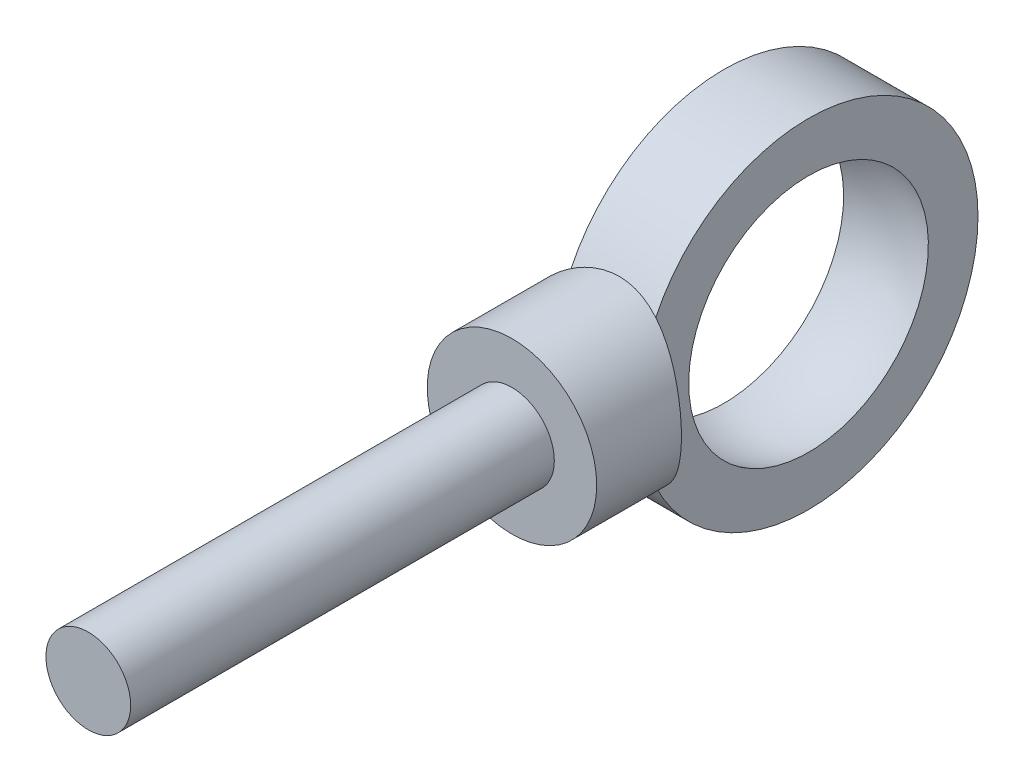
ISO-10303-21;
HEADER;
FILE_DESCRIPTION(('STEP AP214'),'2;1');
FILE_NAME('part.step','',(''),(''),'','','');
FILE_SCHEMA(('AUTOMOTIVE_DESIGN { 1 0 10303 214 1 1 1 1 }'));
ENDSEC;
DATA;
#1=APPLICATION_CONTEXT('core data for automotive mechanical design processes');
#2=APPLICATION_PROTOCOL_DEFINITION('international standard','automotive_design',2000,#1);
#3=PRODUCT_CONTEXT('',#1,'mechanical');
#4=PRODUCT('Part','Part','',(#3));
#5=PRODUCT_RELATED_PRODUCT_CATEGORY('part','',(#4));
#6=PRODUCT_DEFINITION_FORMATION('','',#4);
#7=PRODUCT_DEFINITION_CONTEXT('part definition',#1,'design');
#8=PRODUCT_DEFINITION('design','',#6,#7);
#9=PRODUCT_DEFINITION_SHAPE('','',#8);
#10=(LENGTH_UNIT() NAMED_UNIT(*) SI_UNIT(.MILLI.,.METRE.));
#11=(NAMED_UNIT(*) PLANE_ANGLE_UNIT() SI_UNIT($,.RADIAN.));
#12=(NAMED_UNIT(*) SI_UNIT($,.STERADIAN.) SOLID_ANGLE_UNIT());
#13=UNCERTAINTY_MEASURE_WITH_UNIT(LENGTH_MEASURE(1.E-05),#10,'distance_accuracy_value','');
#14=(GEOMETRIC_REPRESENTATION_CONTEXT(3) GLOBAL_UNCERTAINTY_ASSIGNED_CONTEXT((#13)) GLOBAL_UNIT_ASSIGNED_CONTEXT((#10,
#11,#12)) REPRESENTATION_CONTEXT('',''));
#15=CARTESIAN_POINT('',(0.,0.,0.));
#16=DIRECTION('',(0.,0.,1.));
#17=DIRECTION('',(1.,0.,0.));
#18=AXIS2_PLACEMENT_3D('',#15,#16,#17);
#19=CARTESIAN_POINT('',(5.,20.,0.));
#20=DIRECTION('',(1.,0.,0.));
#21=DIRECTION('',(0.,0.,-1.));
#22=AXIS2_PLACEMENT_3D('',#19,#20,#21);
#23=PLANE('',#22);
#24=CARTESIAN_POINT('',(5.,0.,0.));
#25=DIRECTION('',(1.,0.,0.));
#26=DIRECTION('',(0.,0.,-1.));
#27=AXIS2_PLACEMENT_3D('',#24,#25,#26);
#28=CIRCLE('',#27,20.);
#29=CARTESIAN_POINT('',(5.,8.66025403784439,18.02775637732));
#30=VERTEX_POINT('',#29);
#31=CARTESIAN_POINT('',(5.,-8.66025403784439,18.02775637732));
#32=VERTEX_POINT('',#31);
#33=EDGE_CURVE('E84',#30,#32,#28,.T.);
#34=ORIENTED_EDGE('',*,*,#33,.T.);
#35=EDGE_CURVE('E59',#32,#30,#28,.T.);
#36=ORIENTED_EDGE('',*,*,#35,.T.);
#37=EDGE_LOOP('',(#34,#36));
#38=FACE_BOUND('',#37,.T.);
#39=CARTESIAN_POINT('',(5.,0.,0.));
#40=DIRECTION('',(1.,0.,0.));
#41=DIRECTION('',(0.,0.,-1.));
#42=AXIS2_PLACEMENT_3D('',#39,#40,#41);
#43=CIRCLE('',#42,14.142135623731);
#44=CARTESIAN_POINT('',(5.,14.142135623731,0.));
#45=VERTEX_POINT('',#44);
#46=EDGE_CURVE('E93',#45,#45,#43,.T.);
#47=ORIENTED_EDGE('',*,*,#46,.F.);
#48=EDGE_LOOP('',(#47));
#49=FACE_BOUND('',#48,.T.);
#50=ADVANCED_FACE('F37',(#38,#49),#23,.T.);
#51=CARTESIAN_POINT('',(0.,0.,0.));
#52=DIRECTION('',(1.,0.,0.));
#53=DIRECTION('',(0.,1.,0.));
#54=AXIS2_PLACEMENT_3D('',#51,#52,#53);
#55=SPHERICAL_SURFACE('',#54,15.);
#56=CARTESIAN_POINT('',(-5.,0.,0.));
#57=DIRECTION('',(1.,0.,0.));
#58=DIRECTION('',(0.,0.,-1.));
#59=AXIS2_PLACEMENT_3D('',#56,#57,#58);
#60=CIRCLE('',#59,14.142135623731);
#61=CARTESIAN_POINT('',(-5.,14.142135623731,0.));
#62=VERTEX_POINT('',#61);
#63=EDGE_CURVE('E78',#62,#62,#60,.T.);
#64=CARTESIAN_POINT('',(5.,14.142135623731,0.));
#65=CARTESIAN_POINT('',(4.89987464769116,14.1775354752806,0.));
#66=CARTESIAN_POINT('',(4.79937324095601,14.2118716641264,0.));
#67=CARTESIAN_POINT('',(4.59766390743395,14.2784019890307,0.));
#68=CARTESIAN_POINT('',(4.49645598064704,14.3105961250893,0.));
#69=CARTESIAN_POINT('',(4.29337919582231,14.3728276170393,0.));
#70=CARTESIAN_POINT('',(4.19151033778448,14.4028649729307,0.));
#71=CARTESIAN_POINT('',(3.98715766281383,14.4607694090384,0.));
#72=CARTESIAN_POINT('',(3.884673845881,14.4886364892545,0.));
#73=CARTESIAN_POINT('',(3.6791374800088,14.5421877881638,0.));
#74=CARTESIAN_POINT('',(3.57608493106942,14.567872006857,0.));
#75=CARTESIAN_POINT('',(3.36945759076615,14.6170460001783,0.));
#76=CARTESIAN_POINT('',(3.26588279940225,14.6405357748065,0.));
#77=CARTESIAN_POINT('',(3.05825769777909,14.6853102824159,0.));
#78=CARTESIAN_POINT('',(2.95420738751983,14.7065950153971,0.));
#79=CARTESIAN_POINT('',(2.7456781865878,14.7469498381868,0.));
#80=CARTESIAN_POINT('',(2.64119929591503,14.7660199279953,0.));
#81=CARTESIAN_POINT('',(2.43186006585785,14.8019368616094,0.));
#82=CARTESIAN_POINT('',(2.32699972647344,14.8187837054149,0.));
#83=CARTESIAN_POINT('',(2.1169449028027,14.8502465472227,0.));
#84=CARTESIAN_POINT('',(2.01175041851636,14.8648625452249,0.));
#85=CARTESIAN_POINT('',(1.80107475957995,14.891857101962,0.));
#86=CARTESIAN_POINT('',(1.69559358492986,14.9042356606969,0.));
#87=CARTESIAN_POINT('',(1.48439212913598,14.9267497547791,0.));
#88=CARTESIAN_POINT('',(1.37867184799218,14.9368852901264,0.));
#89=CARTESIAN_POINT('',(1.1670398709442,14.954908765167,0.));
#90=CARTESIAN_POINT('',(1.06112817504002,14.9627967048603,0.));
#91=CARTESIAN_POINT('',(0.849161146554356,14.9763214302452,0.));
#92=CARTESIAN_POINT('',(0.743105813972871,14.9819582159369,0.));
#93=CARTESIAN_POINT('',(0.530899355011923,14.9909780904946,0.));
#94=CARTESIAN_POINT('',(0.424748228632459,14.9943611793605,0.));
#95=CARTESIAN_POINT('',(0.212398068168664,14.9988721341132,0.));
#96=CARTESIAN_POINT('',(0.106199034084331,15.,0.));
#97=CARTESIAN_POINT('',(-0.106199034084333,15.,0.));
#98=CARTESIAN_POINT('',(-0.212398068168665,14.9988721341132,0.));
#99=CARTESIAN_POINT('',(-0.424748228632461,14.9943611793605,0.));
#100=CARTESIAN_POINT('',(-0.530899355011924,14.9909780904946,0.));
#101=CARTESIAN_POINT('',(-0.743105813972873,14.9819582159369,0.));
#102=CARTESIAN_POINT('',(-0.849161146554358,14.9763214302452,0.));
#103=CARTESIAN_POINT('',(-1.06112817504002,14.9627967048603,0.));
#104=CARTESIAN_POINT('',(-1.1670398709442,14.954908765167,0.));
#105=CARTESIAN_POINT('',(-1.37867184799218,14.9368852901264,0.));
#106=CARTESIAN_POINT('',(-1.48439212913598,14.9267497547791,0.));
#107=CARTESIAN_POINT('',(-1.69559358492987,14.9042356606969,0.));
#108=CARTESIAN_POINT('',(-1.80107475957995,14.891857101962,0.));
#109=CARTESIAN_POINT('',(-2.01175041851636,14.8648625452249,0.));
#110=CARTESIAN_POINT('',(-2.1169449028027,14.8502465472227,0.));
#111=CARTESIAN_POINT('',(-2.32699972647344,14.8187837054149,0.));
#112=CARTESIAN_POINT('',(-2.43186006585785,14.8019368616094,0.));
#113=CARTESIAN_POINT('',(-2.64119929591503,14.7660199279953,0.));
#114=CARTESIAN_POINT('',(-2.7456781865878,14.7469498381868,0.));
#115=CARTESIAN_POINT('',(-2.95420738751983,14.7065950153971,0.));
#116=CARTESIAN_POINT('',(-3.05825769777909,14.6853102824159,0.));
#117=CARTESIAN_POINT('',(-3.26588279940225,14.6405357748065,0.));
#118=CARTESIAN_POINT('',(-3.36945759076615,14.6170460001783,0.));
#119=CARTESIAN_POINT('',(-3.57608493106942,14.567872006857,0.));
#120=CARTESIAN_POINT('',(-3.6791374800088,14.5421877881638,0.));
#121=CARTESIAN_POINT('',(-3.88467384588101,14.4886364892545,0.));
#122=CARTESIAN_POINT('',(-3.98715766281383,14.4607694090384,0.));
#123=CARTESIAN_POINT('',(-4.19151033778449,14.4028649729307,0.));
#124=CARTESIAN_POINT('',(-4.29337919582231,14.3728276170393,0.));
#125=CARTESIAN_POINT('',(-4.49645598064704,14.3105961250893,0.));
#126=CARTESIAN_POINT('',(-4.59766390743395,14.2784019890307,0.));
#127=CARTESIAN_POINT('',(-4.79937324095601,14.2118716641264,0.));
#128=CARTESIAN_POINT('',(-4.89987464769116,14.1775354752806,0.));
#129=CARTESIAN_POINT('',(-5.,14.142135623731,0.));
#130=B_SPLINE_CURVE_WITH_KNOTS('',3,(#64,#65,#66,#67,#68,#69,#70,#71,#72,#73,#74,#75,#76,#77,
#78,#79,#80,#81,#82,#83,#84,#85,#86,#87,#88,#89,#90,#91,#92,#93,#94,#95,#96,#97,#98,#99,#100,
#101,#102,#103,#104,#105,#106,#107,#108,#109,#110,#111,#112,#113,#114,#115,#116,#117,#118,#119,
#120,#121,#122,#123,#124,#125,#126,#127,#128,#129),.UNSPECIFIED.,.F.,.F.,(4,2,2,2,2,2,2,2,2,2,2,
2,2,2,2,2,2,2,2,2,2,2,2,2,2,2,2,2,2,2,2,2,4),(0.,0.318591113958758,0.637182227917518,
0.955773341876277,1.27436445583504,1.59295556979379,1.91154668375255,2.23013779771131,
2.54872891167007,2.86732002562883,3.18591113958759,3.50450225354635,3.82309336750511,
4.14168448146386,4.46027559542262,4.77886670938138,5.09745782334014,5.4160489372989,
5.73464005125766,6.05323116521642,6.37182227917517,6.69041339313393,7.00900450709269,
7.32759562105145,7.64618673501021,7.96477784896897,8.28336896292772,8.60196007688648,
8.92055119084524,9.239142304804,9.55773341876276,9.87632453272152,10.1949156466803),.UNSPECIFIED.);
#131=EDGE_CURVE('BSEAM125',#45,#62,#130,.T.);
#132=ORIENTED_EDGE('',*,*,#46,.T.);
#133=ORIENTED_EDGE('',*,*,#63,.F.);
#134=ORIENTED_EDGE('',*,*,#131,.T.);
#135=ORIENTED_EDGE('',*,*,#131,.F.);
#136=EDGE_LOOP('',(#132,#134,#133,#135));
#137=FACE_BOUND('',#136,.T.);
#138=ADVANCED_FACE('F125',(#137),#55,.F.);
#139=CARTESIAN_POINT('',(-5.,20.,0.));
#140=DIRECTION('',(-1.,0.,0.));
#141=DIRECTION('',(0.,0.,1.));
#142=AXIS2_PLACEMENT_3D('',#139,#140,#141);
#143=PLANE('',#142);
#144=ORIENTED_EDGE('',*,*,#63,.T.);
#145=EDGE_LOOP('',(#144));
#146=FACE_BOUND('',#145,.T.);
#147=CARTESIAN_POINT('',(-5.,0.,0.));
#148=DIRECTION('',(1.,0.,0.));
#149=DIRECTION('',(0.,0.,-1.));
#150=AXIS2_PLACEMENT_3D('',#147,#148,#149);
#151=CIRCLE('',#150,20.);
#152=CARTESIAN_POINT('',(-5.00000000000001,8.66025403784442,18.02775637732));
#153=VERTEX_POINT('',#152);
#154=CARTESIAN_POINT('',(-5.,-8.66025403784439,18.0277563773199));
#155=VERTEX_POINT('',#154);
#156=EDGE_CURVE('E71',#153,#155,#151,.T.);
#157=ORIENTED_EDGE('',*,*,#156,.F.);
#158=EDGE_CURVE('E73',#155,#153,#151,.T.);
#159=ORIENTED_EDGE('',*,*,#158,.F.);
#160=EDGE_LOOP('',(#157,#159));
#161=FACE_BOUND('',#160,.T.);
#162=ADVANCED_FACE('F72',(#146,#161),#143,.T.);
#163=CARTESIAN_POINT('',(25.8615611192931,0.,0.));
#164=DIRECTION('',(1.,0.,0.));
#165=DIRECTION('',(0.,0.,-1.));
#166=AXIS2_PLACEMENT_3D('',#163,#164,#165);
#167=CYLINDRICAL_SURFACE('',#166,20.);
#168=CARTESIAN_POINT('',(10.,0.,20.));
#169=CARTESIAN_POINT('',(9.99999913115436,-0.26297774757047,19.9999992010162));
#170=CARTESIAN_POINT('',(9.98961448605541,-0.525973881907791,19.9948010837));
#171=CARTESIAN_POINT('',(9.94819417514042,-1.05002923117121,19.9741395354228));
#172=CARTESIAN_POINT('',(9.91714952546693,-1.31108755349614,19.9586716387275));
#173=CARTESIAN_POINT('',(9.83470808959855,-1.82963226043826,19.9178362229901));
#174=CARTESIAN_POINT('',(9.7832771145179,-2.08711188872545,19.8924520749392));
#175=CARTESIAN_POINT('',(9.6606617858704,-2.59618182802919,19.8324363448083));
#176=CARTESIAN_POINT('',(9.58947940784877,-2.84777272531199,19.7978056875818));
#177=CARTESIAN_POINT('',(9.42843099782793,-3.34246836822569,19.7203030234441));
#178=CARTESIAN_POINT('',(9.33863913254443,-3.58560245696295,19.6774637808779));
#179=CARTESIAN_POINT('',(9.14105567831592,-4.06298432085465,19.5844658749963));
#180=CARTESIAN_POINT('',(9.03326370182768,-4.29723190454894,19.534307054093));
#181=CARTESIAN_POINT('',(8.80063076347475,-4.75551398861711,19.4278257394007));
#182=CARTESIAN_POINT('',(8.67579609735522,-4.97955221985717,19.371505523214));
#183=CARTESIAN_POINT('',(8.40991307098158,-5.41653080360957,19.2538936046229));
#184=CARTESIAN_POINT('',(8.2688583184689,-5.62946673237805,19.1925999450288));
#185=CARTESIAN_POINT('',(7.96249543661431,-6.0557115363693,19.0625536763854));
#186=CARTESIAN_POINT('',(7.7962377965806,-6.2682689260733,18.9935741626949));
#187=CARTESIAN_POINT('',(7.4475548696851,-6.67880739057353,18.8531326273725));
#188=CARTESIAN_POINT('',(7.26512865857501,-6.87678763090649,18.7816704639664));
#189=CARTESIAN_POINT('',(6.88496142032971,-7.25738906236845,18.6379106306311));
#190=CARTESIAN_POINT('',(6.68721091579405,-7.44000060064986,18.5656124675679));
#191=CARTESIAN_POINT('',(6.27739804377523,-7.78888361749309,18.4219676840917));
#192=CARTESIAN_POINT('',(6.06533299917856,-7.95515202519227,18.3506212446753));
#193=CARTESIAN_POINT('',(5.61080680137959,-8.2827111057377,18.2052535437119));
#194=CARTESIAN_POINT('',(5.3672646356158,-8.44260565220417,18.1314567024133));
#195=CARTESIAN_POINT('',(4.86604152016689,-8.74109142208519,17.9894590508883));
#196=CARTESIAN_POINT('',(4.60836662455359,-8.87969167215242,17.9212558752544));
#197=CARTESIAN_POINT('',(4.08030079686866,-9.13438777848807,17.7927881626278));
#198=CARTESIAN_POINT('',(3.8099137450612,-9.25049044721743,17.7325212242509));
#199=CARTESIAN_POINT('',(3.25811404654998,-9.45894522420918,17.6222099564149));
#200=CARTESIAN_POINT('',(2.97670262554418,-9.55129996419766,17.5721644943465));
#201=CARTESIAN_POINT('',(2.42208495994054,-9.70625458779874,17.4870229092242));
#202=CARTESIAN_POINT('',(2.14939374522003,-9.77030307761468,17.4512120054423));
#203=CARTESIAN_POINT('',(1.59828353446418,-9.87543221046261,17.3919377517219));
#204=CARTESIAN_POINT('',(1.3198647839724,-9.91651383598184,17.368473873599));
#205=CARTESIAN_POINT('',(0.759985400813501,-9.97504777353869,17.3349233192211));
#206=CARTESIAN_POINT('',(0.47852754465299,-9.99252007209236,17.3248253281998));
#207=CARTESIAN_POINT('',(-0.0850025098370454,-10.0036080043825,17.3184259915651));
#208=CARTESIAN_POINT('',(-0.367074646986475,-9.99722591425207,17.3221233296318));
#209=CARTESIAN_POINT('',(-0.895404797903439,-9.96291632672931,17.3418743842694));
#210=CARTESIAN_POINT('',(-1.14190017135773,-9.93766509151721,17.3563927185974));
#211=CARTESIAN_POINT('',(-1.63163922429553,-9.8690882825972,17.3954780340008));
#212=CARTESIAN_POINT('',(-1.8748818003645,-9.82575672853391,17.4200483398744));
#213=CARTESIAN_POINT('',(-2.35639172502936,-9.72152759312325,17.4784283554102));
#214=CARTESIAN_POINT('',(-2.59465974040343,-9.66063238238804,17.5122368181421));
#215=CARTESIAN_POINT('',(-3.06495356423537,-9.52187989459161,17.5880654989193));
#216=CARTESIAN_POINT('',(-3.29697683978231,-9.44401584795466,17.6300889935922));
#217=CARTESIAN_POINT('',(-3.75871059152812,-9.27007793534025,17.7221768246774));
#218=CARTESIAN_POINT('',(-3.98824705326725,-9.17362860412847,17.7724029635355));
#219=CARTESIAN_POINT('',(-4.43843816949664,-8.96447979140212,17.878810533816));
#220=CARTESIAN_POINT('',(-4.65908984189431,-8.85177491107831,17.9349939421243));
#221=CARTESIAN_POINT('',(-5.09056177461597,-8.61087933619458,18.0518884826287));
#222=CARTESIAN_POINT('',(-5.30138026188528,-8.48268586368169,18.1126004262899));
#223=CARTESIAN_POINT('',(-5.71235236620884,-8.21155546672611,18.2371218065418));
#224=CARTESIAN_POINT('',(-5.9125053319951,-8.06861764351119,18.3009314318325));
#225=CARTESIAN_POINT('',(-6.32613167998318,-7.74962298190964,18.4384710076206));
#226=CARTESIAN_POINT('',(-6.53806610333902,-7.57166567582239,18.5124312542501));
#227=CARTESIAN_POINT('',(-6.9463748641624,-7.19890817206694,18.6605447929763));
#228=CARTESIAN_POINT('',(-7.14275307875469,-7.00411219662653,18.7346980321841));
#229=CARTESIAN_POINT('',(-7.51914658075992,-6.5984132459434,18.8814062531242));
#230=CARTESIAN_POINT('',(-7.69914815975715,-6.38749704374536,18.9539598580541));
#231=CARTESIAN_POINT('',(-8.04145286350265,-5.9507961704325,19.0955673475654));
#232=CARTESIAN_POINT('',(-8.20376295747981,-5.72501741077281,19.164622604476));
#233=CARTESIAN_POINT('',(-8.51679586548893,-5.24872768197162,19.3006480329725));
#234=CARTESIAN_POINT('',(-8.66662084597192,-4.99755374827171,19.3673693587667));
#235=CARTESIAN_POINT('',(-8.94436923693038,-4.48152997851449,19.4932401539485));
#236=CARTESIAN_POINT('',(-9.07229162748596,-4.21667950634011,19.5523892706948));
#237=CARTESIAN_POINT('',(-9.30479430346283,-3.67526022803788,19.6613492326779));
#238=CARTESIAN_POINT('',(-9.40938943023277,-3.39869900661396,19.7111660121174));
#239=CARTESIAN_POINT('',(-9.59405077887223,-2.83582264507486,19.7999810198758));
#240=CARTESIAN_POINT('',(-9.6741198224884,-2.54950863124167,19.8389804926862));
#241=CARTESIAN_POINT('',(-9.80306586115913,-1.99360082076711,19.9021913169255));
#242=CARTESIAN_POINT('',(-9.85397724296121,-1.72458658463508,19.9273600412885));
#243=CARTESIAN_POINT('',(-9.93361515809334,-1.18250594424724,19.9668602547768));
#244=CARTESIAN_POINT('',(-9.96234289811999,-0.909439761223921,19.9811923333691));
#245=CARTESIAN_POINT('',(-9.99722632078262,-0.361621452061379,19.9986076087938));
#246=CARTESIAN_POINT('',(-10.0033910283278,-0.0868700440476463,20.0016953032259));
#247=CARTESIAN_POINT('',(-9.99308881237029,0.462095284936299,19.996544733302));
#248=CARTESIAN_POINT('',(-9.97662289045094,0.736309229155637,19.9883069701865));
#249=CARTESIAN_POINT('',(-9.92343793830234,1.26069578442055,19.9618171280824));
#250=CARTESIAN_POINT('',(-9.88839042717946,1.51108216427541,19.9443921243345));
#251=CARTESIAN_POINT('',(-9.79963000482065,2.00770334634759,19.9005341339856));
#252=CARTESIAN_POINT('',(-9.74591829455947,2.25393841461835,19.8741017269811));
#253=CARTESIAN_POINT('',(-9.62038600790449,2.7406844611906,19.812845023159));
#254=CARTESIAN_POINT('',(-9.54856442437243,2.98119512032807,19.7780202596251));
#255=CARTESIAN_POINT('',(-9.38750534162718,3.4550508210735,19.7007681992835));
#256=CARTESIAN_POINT('',(-9.29826711065178,3.68839556112771,19.6583405830473));
#257=CARTESIAN_POINT('',(-9.1003752756805,4.15316088617014,19.5655046555384));
#258=CARTESIAN_POINT('',(-8.99124296116597,4.38433936906093,19.5149041886911));
#259=CARTESIAN_POINT('',(-8.75625210363736,4.83663774643758,19.4077573479828));
#260=CARTESIAN_POINT('',(-8.63038758229553,5.05775400766402,19.3512088504371));
#261=CARTESIAN_POINT('',(-8.22905651355294,5.70436813169987,19.1744474473865));
#262=CARTESIAN_POINT('',(-7.92974633233899,6.11337858448959,19.0470672570173));
#263=CARTESIAN_POINT('',(-7.24229945831006,6.91779518371265,18.7707873202954));
#264=CARTESIAN_POINT('',(-6.84832629200834,7.30792110762595,18.6210027147805));
#265=CARTESIAN_POINT('',(-6.21273944140975,7.84082560671492,18.3999640224111));
#266=CARTESIAN_POINT('',(-5.99326478653577,8.00984942409511,18.3268393772916));
#267=CARTESIAN_POINT('',(-5.54026055723577,8.32960568094727,18.183737266458));
#268=CARTESIAN_POINT('',(-5.30672896354593,8.4803354830786,18.1137602554328));
#269=CARTESIAN_POINT('',(-4.81507400615665,8.76928163027866,17.9757225676596));
#270=CARTESIAN_POINT('',(-4.55630669324831,8.90652817819507,17.9079221139822));
#271=CARTESIAN_POINT('',(-4.02618845544831,9.15837639012034,17.7804404562871));
#272=CARTESIAN_POINT('',(-3.75484365938643,9.27298894306127,17.7207553524022));
#273=CARTESIAN_POINT('',(-3.20145013670093,9.47827705930681,17.6118078617936));
#274=CARTESIAN_POINT('',(-2.91941021837733,9.568971851296,17.5625371088176));
#275=CARTESIAN_POINT('',(-2.34661678464843,9.72530086409336,17.4764560330943));
#276=CARTESIAN_POINT('',(-2.05586462593421,9.79093896514152,17.4396437811433));
#277=CARTESIAN_POINT('',(-1.49647520328126,9.89107565144743,17.3830260812378));
#278=CARTESIAN_POINT('',(-1.22839424532747,9.92795857968716,17.3619273114046));
#279=CARTESIAN_POINT('',(-0.68943934069935,9.97987692141645,17.332136815937));
#280=CARTESIAN_POINT('',(-0.41856558523287,9.99491382071395,17.3234442465237));
#281=CARTESIAN_POINT('',(0.123513568898105,10.0029096686844,17.3188284226879));
#282=CARTESIAN_POINT('',(0.394718807790042,9.9958767833924,17.3229004452416));
#283=CARTESIAN_POINT('',(0.935172109763848,9.95985898725887,17.3436339919872));
#284=CARTESIAN_POINT('',(1.20442025251278,9.93087497508662,17.3602950007916));
#285=CARTESIAN_POINT('',(1.71311444539335,9.85519722920277,17.4033551463061));
#286=CARTESIAN_POINT('',(1.95294800892505,9.81046230963215,17.4286705637748));
#287=CARTESIAN_POINT('',(2.42772919782683,9.70388285528388,17.4882355534742));
#288=CARTESIAN_POINT('',(2.66267517883646,9.6420326592858,17.5224880816187));
#289=CARTESIAN_POINT('',(3.12622361640298,9.50186064219782,17.5988921487312));
#290=CARTESIAN_POINT('',(3.35482710491828,9.42354151869526,17.6410423939411));
#291=CARTESIAN_POINT('',(3.80469848834419,9.25107208633864,17.7320944008379));
#292=CARTESIAN_POINT('',(4.02596303893557,9.15691467555994,17.7809991895098));
#293=CARTESIAN_POINT('',(4.47462589212292,8.94668289722953,17.8877520145129));
#294=CARTESIAN_POINT('',(4.70144417860012,8.82956366921284,17.9459794825375));
#295=CARTESIAN_POINT('',(5.14454543087202,8.57895403368727,18.067122458149));
#296=CARTESIAN_POINT('',(5.36082745248372,8.44546216273868,18.130038384608));
#297=CARTESIAN_POINT('',(5.7820513773595,8.16285657798003,18.2590224525039));
#298=CARTESIAN_POINT('',(5.98698926853812,8.01373739051541,18.3250916939848));
#299=CARTESIAN_POINT('',(6.38466859957026,7.70065351710477,18.4588439084551));
#300=CARTESIAN_POINT('',(6.57740828775337,7.53668670721057,18.5265271112979));
#301=CARTESIAN_POINT('',(6.97258907087019,7.17380336462423,18.6702735648096));
#302=CARTESIAN_POINT('',(7.17335317456234,6.97306234663123,18.746353564782));
#303=CARTESIAN_POINT('',(7.55735140773604,6.55492133587247,18.8966226391637));
#304=CARTESIAN_POINT('',(7.74059048205456,6.33752607360945,18.9708122426046));
#305=CARTESIAN_POINT('',(8.08857822010409,5.88693376044406,19.1154396310611));
#306=CARTESIAN_POINT('',(8.25331243664264,5.65372458790795,19.1858744624017));
#307=CARTESIAN_POINT('',(8.56287912764054,5.1728954421103,19.3210638569054));
#308=CARTESIAN_POINT('',(8.70771274884002,4.92527630037179,19.3858187472881));
#309=CARTESIAN_POINT('',(8.97718827799675,4.41518835199794,19.5083417849818));
#310=CARTESIAN_POINT('',(9.10167533033799,4.15262447046932,19.5660555714726));
#311=CARTESIAN_POINT('',(9.32784736322444,3.61607511779453,19.6722841833782));
#312=CARTESIAN_POINT('',(9.42953513993486,3.34209105214395,19.7208001367275));
#313=CARTESIAN_POINT('',(9.60868749330685,2.78539452130531,19.8070877528213));
#314=CARTESIAN_POINT('',(9.68620928789517,2.50270444198693,19.8448847753657));
#315=CARTESIAN_POINT('',(9.81627609006845,1.93047321727416,19.908692874149));
#316=CARTESIAN_POINT('',(9.86883635479209,1.64093637072212,19.9347111494098));
#317=CARTESIAN_POINT('',(9.93894890350841,1.12608352412093,19.9695276660452));
#318=CARTESIAN_POINT('',(9.96182346631399,0.901651680276708,19.9809348086311));
#319=CARTESIAN_POINT('',(9.99234959757145,0.451484431282409,19.9961714231232));
#320=CARTESIAN_POINT('',(10.0000007458465,0.225748990324602,20.0000006858747));
#321=CARTESIAN_POINT('',(10.,0.,20.));
#322=B_SPLINE_CURVE_WITH_KNOTS('',3,(#168,#169,#170,#171,#172,#173,#174,#175,#176,#177,#178,
#179,#180,#181,#182,#183,#184,#185,#186,#187,#188,#189,#190,#191,#192,#193,#194,#195,#196,#197,
#198,#199,#200,#201,#202,#203,#204,#205,#206,#207,#208,#209,#210,#211,#212,#213,#214,#215,#216,
#217,#218,#219,#220,#221,#222,#223,#224,#225,#226,#227,#228,#229,#230,#231,#232,#233,#234,#235,
#236,#237,#238,#239,#240,#241,#242,#243,#244,#245,#246,#247,#248,#249,#250,#251,#252,#253,#254,
#255,#256,#257,#258,#259,#260,#261,#262,#263,#264,#265,#266,#267,#268,#269,#270,#271,#272,#273,
#274,#275,#276,#277,#278,#279,#280,#281,#282,#283,#284,#285,#286,#287,#288,#289,#290,#291,#292,
#293,#294,#295,#296,#297,#298,#299,#300,#301,#302,#303,#304,#305,#306,#307,#308,#309,#310,#311,
#312,#313,#314,#315,#316,#317,#318,#319,#320,#321),.UNSPECIFIED.,.T.,.F.,(4,2,2,2,2,2,2,2,2,2,2,
2,2,2,2,2,2,2,2,2,2,2,2,2,2,2,2,2,2,2,2,2,2,2,2,2,2,2,2,2,2,2,2,2,2,2,2,2,2,2,2,2,2,2,2,2,2,2,2,
2,2,2,2,2,2,2,2,2,2,2,2,2,2,2,2,2,4),(0.,0.788710589250999,1.57776436803952,2.36814706638947,
3.15845073874465,3.94566328103175,4.73289277422682,5.51983223968626,6.30708290401818,
7.14179607204602,7.9765569858161,8.81183834708133,9.64727635829488,10.5477781072243,
11.447897073936,12.3477430494904,13.2474892618302,14.0934532489038,14.9393810441651,
15.7845922682139,16.6297228461314,17.3734776288846,18.1174786157194,18.8613792297722,
19.6055771618311,20.3667813084855,21.1282388516736,21.889833169209,22.6514739387577,
23.509891476961,24.3680943913845,25.2270091977564,26.0855844184834,26.9843425878092,
27.8831425974923,28.781369127958,29.679492277851,30.5032194900487,31.3269018918016,
32.1502547956571,32.9735712608452,33.7329722323225,34.4923243480979,35.2517187027837,
36.0111449703724,36.7921013676949,37.5733375502822,39.1349970223262,40.850013011907,
41.7087612506847,42.5676331434657,43.4684238669888,44.3687801699595,45.2684104094407,
46.167901277019,46.9810473193187,47.7941380547513,48.6069279741809,49.4196846201562,
50.1547113408423,50.889981477547,51.6251312717133,52.3606115917997,53.1452977478638,
53.9300540928963,54.7150862327853,55.5002308492403,56.3809909668478,57.2615018327172,
58.1426954259119,59.0238382204153,59.9114030040692,60.7988588747469,61.6841972652663,
62.5689938151569,63.2460309664337,63.9230868041487),.UNSPECIFIED.);
#323=EDGE_CURVE('E82',#32,#155,#322,.T.);
#324=ORIENTED_EDGE('',*,*,#323,.T.);
#325=ORIENTED_EDGE('',*,*,#158,.T.);
#326=CARTESIAN_POINT('',(5.,8.66025403784439,18.02775637732));
#327=CARTESIAN_POINT('',(4.7802485344656,8.78714135980011,17.9667939267157));
#328=CARTESIAN_POINT('',(4.55514050694245,8.90594062068071,17.908082080176));
#329=CARTESIAN_POINT('',(4.09517434405986,9.12658701518309,17.7966507617112));
#330=CARTESIAN_POINT('',(3.86031050590511,9.22842405416473,17.7439348640001));
#331=CARTESIAN_POINT('',(3.38144812142058,9.41445481229256,17.645937523298));
#332=CARTESIAN_POINT('',(3.13742777284412,9.49860279651343,17.6006754158426));
#333=CARTESIAN_POINT('',(2.64225269153677,9.64807560305856,17.5191865753328));
#334=CARTESIAN_POINT('',(2.39109936419915,9.71340410545961,17.4829580759779));
#335=CARTESIAN_POINT('',(1.8822033291408,9.82473513917197,17.4206393748742));
#336=CARTESIAN_POINT('',(1.62443796362973,9.870657934496,17.3945910346075));
#337=CARTESIAN_POINT('',(1.10519187774869,9.94219448327925,17.3538028718843));
#338=CARTESIAN_POINT('',(0.843710956729762,9.96780713566648,17.3390636625302));
#339=CARTESIAN_POINT('',(0.319651767693986,9.99832888097903,17.3214818114572));
#340=CARTESIAN_POINT('',(0.0570766233725127,10.0032781470576,17.3186160857402));
#341=CARTESIAN_POINT('',(-0.467489780828028,9.9925104355749,17.3248311876876));
#342=CARTESIAN_POINT('',(-0.729481085220577,9.97679509158153,17.3339110710342));
#343=CARTESIAN_POINT('',(-1.23438227852263,9.92655911697705,17.3627241726764));
#344=CARTESIAN_POINT('',(-1.47745775639948,9.89328064321712,17.3817530025584));
#345=CARTESIAN_POINT('',(-1.95960577237211,9.80917083621691,17.4293573752177));
#346=CARTESIAN_POINT('',(-2.19867815014442,9.75833880171421,17.4579332993987));
#347=CARTESIAN_POINT('',(-2.67148987088898,9.63963695569759,17.5237552891384));
#348=CARTESIAN_POINT('',(-2.90522555861601,9.57175582737225,17.5610071123682));
#349=CARTESIAN_POINT('',(-3.36587046041521,9.41964629892097,17.6430643181964));
#350=CARTESIAN_POINT('',(-3.59278149865912,9.33542231277096,17.6878676608075));
#351=CARTESIAN_POINT('',(-4.02053371214088,9.15884217157416,17.7798959094712));
#352=CARTESIAN_POINT('',(-4.22199062708287,9.06771172854685,17.826624304423));
#353=CARTESIAN_POINT('',(-4.61693747258245,8.87311741706842,17.9242728866386));
#354=CARTESIAN_POINT('',(-4.810451693735,8.76969561866458,17.9751786008243));
#355=CARTESIAN_POINT('',(-5.,8.66025403784439,18.0277563773199));
#356=B_SPLINE_CURVE_WITH_KNOTS('',3,(#326,#327,#328,#329,#330,#331,#332,#333,#334,#335,#336,
#337,#338,#339,#340,#341,#342,#343,#344,#345,#346,#347,#348,#349,#350,#351,#352,#353,#354,#355),
.UNSPECIFIED.,.F.,.F.,(4,2,2,2,2,2,2,2,2,2,2,2,2,2,4),(0.,0.782812888886723,1.56608999740468,
2.35136801016183,3.13649236044659,3.92481205315968,4.7131744800571,5.50000347991826,
6.28677028352666,7.02415819433869,7.76157556710925,8.49948372085674,9.23719285270484,
9.91466053491489,10.5898728149376),.UNSPECIFIED.);
#357=EDGE_CURVE('E40',#30,#153,#356,.T.);
#358=ORIENTED_EDGE('',*,*,#357,.F.);
#359=ORIENTED_EDGE('',*,*,#35,.F.);
#360=EDGE_LOOP('',(#324,#325,#358,#359));
#361=FACE_BOUND('',#360,.T.);
#362=ADVANCED_FACE('F80',(#361),#167,.T.);
#363=CARTESIAN_POINT('',(25.8615611192931,0.,0.));
#364=DIRECTION('',(1.,0.,0.));
#365=DIRECTION('',(0.,0.,-1.));
#366=AXIS2_PLACEMENT_3D('',#363,#364,#365);
#367=CYLINDRICAL_SURFACE('',#366,20.);
#368=ORIENTED_EDGE('',*,*,#33,.F.);
#369=EDGE_CURVE('E91',#30,#32,#322,.T.);
#370=ORIENTED_EDGE('',*,*,#369,.T.);
#371=EDGE_LOOP('',(#368,#370));
#372=FACE_BOUND('',#371,.T.);
#373=ADVANCED_FACE('F112',(#372),#367,.F.);
#374=CARTESIAN_POINT('',(0.,0.,30.));
#375=DIRECTION('',(0.,0.,1.));
#376=DIRECTION('',(1.,0.,0.));
#377=AXIS2_PLACEMENT_3D('',#374,#375,#376);
#378=PLANE('',#377);
#379=CARTESIAN_POINT('',(0.,0.,30.));
#380=DIRECTION('',(0.,0.,1.));
#381=DIRECTION('',(1.,0.,0.));
#382=AXIS2_PLACEMENT_3D('',#379,#380,#381);
#383=CIRCLE('',#382,5.);
#384=CARTESIAN_POINT('',(5.,0.,30.));
#385=VERTEX_POINT('',#384);
#386=EDGE_CURVE('E11',#385,#385,#383,.T.);
#387=ORIENTED_EDGE('',*,*,#386,.F.);
#388=EDGE_LOOP('',(#387));
#389=FACE_BOUND('',#388,.T.);
#390=CARTESIAN_POINT('',(0.,0.,30.));
#391=DIRECTION('',(0.,0.,1.));
#392=DIRECTION('',(1.,0.,0.));
#393=AXIS2_PLACEMENT_3D('',#390,#391,#392);
#394=CIRCLE('',#393,10.);
#395=CARTESIAN_POINT('',(10.,0.,30.));
#396=VERTEX_POINT('',#395);
#397=EDGE_CURVE('E99',#396,#396,#394,.T.);
#398=ORIENTED_EDGE('',*,*,#397,.T.);
#399=EDGE_LOOP('',(#398));
#400=FACE_BOUND('',#399,.T.);
#401=ADVANCED_FACE('F114',(#389,#400),#378,.T.);
#402=CARTESIAN_POINT('',(0.,0.,-20.001));
#403=DIRECTION('',(0.,0.,1.));
#404=DIRECTION('',(1.,0.,0.));
#405=AXIS2_PLACEMENT_3D('',#402,#403,#404);
#406=CYLINDRICAL_SURFACE('',#405,10.);
#407=ORIENTED_EDGE('',*,*,#323,.F.);
#408=ORIENTED_EDGE('',*,*,#369,.F.);
#409=ORIENTED_EDGE('',*,*,#357,.T.);
#410=EDGE_CURVE('E89',#155,#153,#322,.T.);
#411=ORIENTED_EDGE('',*,*,#410,.F.);
#412=EDGE_LOOP('',(#407,#408,#409,#411));
#413=FACE_BOUND('',#412,.T.);
#414=ORIENTED_EDGE('',*,*,#397,.F.);
#415=EDGE_LOOP('',(#414));
#416=FACE_BOUND('',#415,.T.);
#417=ADVANCED_FACE('F87',(#413,#416),#406,.T.);
#418=ORIENTED_EDGE('',*,*,#156,.T.);
#419=ORIENTED_EDGE('',*,*,#410,.T.);
#420=EDGE_LOOP('',(#418,#419));
#421=FACE_BOUND('',#420,.T.);
#422=ADVANCED_FACE('F94',(#421),#367,.F.);
#423=CARTESIAN_POINT('',(0.,0.,80.));
#424=DIRECTION('',(0.,0.,-1.));
#425=DIRECTION('',(-1.,0.,0.));
#426=AXIS2_PLACEMENT_3D('',#423,#424,#425);
#427=CYLINDRICAL_SURFACE('',#426,5.);
#428=CARTESIAN_POINT('',(0.,0.,80.));
#429=DIRECTION('',(0.,0.,1.));
#430=DIRECTION('',(1.,0.,0.));
#431=AXIS2_PLACEMENT_3D('',#428,#429,#430);
#432=CIRCLE('',#431,5.);
#433=CARTESIAN_POINT('',(5.,0.,80.));
#434=VERTEX_POINT('',#433);
#435=EDGE_CURVE('E193',#434,#434,#432,.T.);
#436=ORIENTED_EDGE('',*,*,#435,.F.);
#437=EDGE_LOOP('',(#436));
#438=FACE_BOUND('',#437,.T.);
#439=ORIENTED_EDGE('',*,*,#386,.T.);
#440=EDGE_LOOP('',(#439));
#441=FACE_BOUND('',#440,.T.);
#442=ADVANCED_FACE('F111',(#438,#441),#427,.T.);
#443=CARTESIAN_POINT('',(0.,0.,80.));
#444=DIRECTION('',(0.,0.,1.));
#445=DIRECTION('',(1.,0.,0.));
#446=AXIS2_PLACEMENT_3D('',#443,#444,#445);
#447=PLANE('',#446);
#448=ORIENTED_EDGE('',*,*,#435,.T.);
#449=EDGE_LOOP('',(#448));
#450=FACE_BOUND('',#449,.T.);
#451=ADVANCED_FACE('F179',(#450),#447,.T.);
#452=CLOSED_SHELL('',(#50,#138,#162,#362,#373,#401,#417,#422,#442,#451));
#453=MANIFOLD_SOLID_BREP('B2',#452);
#454=ADVANCED_BREP_SHAPE_REPRESENTATION('',(#18,#453),#14);
#455=SHAPE_DEFINITION_REPRESENTATION(#9,#454);
ENDSEC;
END-ISO-10303-21;
